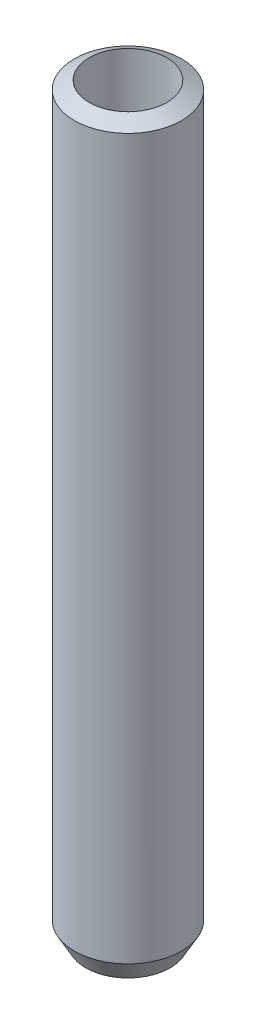
ISO-10303-21;
HEADER;
FILE_DESCRIPTION(('STEP AP214'),'2;1');
FILE_NAME('part.step','',(''),(''),'','','');
FILE_SCHEMA(('AUTOMOTIVE_DESIGN { 1 0 10303 214 1 1 1 1 }'));
ENDSEC;
DATA;
#1=APPLICATION_CONTEXT('core data for automotive mechanical design processes');
#2=APPLICATION_PROTOCOL_DEFINITION('international standard','automotive_design',2000,#1);
#3=PRODUCT_CONTEXT('',#1,'mechanical');
#4=PRODUCT('Part','Part','',(#3));
#5=PRODUCT_RELATED_PRODUCT_CATEGORY('part','',(#4));
#6=PRODUCT_DEFINITION_FORMATION('','',#4);
#7=PRODUCT_DEFINITION_CONTEXT('part definition',#1,'design');
#8=PRODUCT_DEFINITION('design','',#6,#7);
#9=PRODUCT_DEFINITION_SHAPE('','',#8);
#10=(LENGTH_UNIT() NAMED_UNIT(*) SI_UNIT(.MILLI.,.METRE.));
#11=(NAMED_UNIT(*) PLANE_ANGLE_UNIT() SI_UNIT($,.RADIAN.));
#12=(NAMED_UNIT(*) SI_UNIT($,.STERADIAN.) SOLID_ANGLE_UNIT());
#13=UNCERTAINTY_MEASURE_WITH_UNIT(LENGTH_MEASURE(1.E-05),#10,'distance_accuracy_value','');
#14=(GEOMETRIC_REPRESENTATION_CONTEXT(3) GLOBAL_UNCERTAINTY_ASSIGNED_CONTEXT((#13)) GLOBAL_UNIT_ASSIGNED_CONTEXT((#10,
#11,#12)) REPRESENTATION_CONTEXT('',''));
#15=CARTESIAN_POINT('',(0.,0.,0.));
#16=DIRECTION('',(0.,0.,1.));
#17=DIRECTION('',(1.,0.,0.));
#18=AXIS2_PLACEMENT_3D('',#15,#16,#17);
#19=CARTESIAN_POINT('',(0.,350.316945486305,0.));
#20=DIRECTION('',(0.,-1.,0.));
#21=DIRECTION('',(0.,0.,-1.));
#22=AXIS2_PLACEMENT_3D('',#19,#20,#21);
#23=CYLINDRICAL_SURFACE('',#22,25.);
#24=CARTESIAN_POINT('',(0.,345.020617295996,0.));
#25=DIRECTION('',(0.,1.,0.));
#26=DIRECTION('',(0.,0.,1.));
#27=AXIS2_PLACEMENT_3D('',#24,#25,#26);
#28=CIRCLE('',#27,25.);
#29=CARTESIAN_POINT('',(0.,345.020617295996,25.));
#30=VERTEX_POINT('',#29);
#31=EDGE_CURVE('E50',#30,#30,#28,.F.);
#32=ORIENTED_EDGE('',*,*,#31,.T.);
#33=EDGE_LOOP('',(#32));
#34=FACE_BOUND('',#33,.T.);
#35=CARTESIAN_POINT('',(0.,9.45453848438332,0.));
#36=DIRECTION('',(0.,1.,0.));
#37=DIRECTION('',(0.,0.,1.));
#38=AXIS2_PLACEMENT_3D('',#35,#36,#37);
#39=CIRCLE('',#38,25.);
#40=CARTESIAN_POINT('',(0.,9.45453848438332,25.));
#41=VERTEX_POINT('',#40);
#42=EDGE_CURVE('E51',#41,#41,#39,.T.);
#43=ORIENTED_EDGE('',*,*,#42,.T.);
#44=EDGE_LOOP('',(#43));
#45=FACE_BOUND('',#44,.T.);
#46=ADVANCED_FACE('F39',(#34,#45),#23,.T.);
#47=CARTESIAN_POINT('',(0.,0.,0.));
#48=DIRECTION('',(0.,1.,0.));
#49=DIRECTION('',(0.,0.,1.));
#50=AXIS2_PLACEMENT_3D('',#47,#48,#49);
#51=PLANE('',#50);
#52=CARTESIAN_POINT('',(0.,0.,0.));
#53=DIRECTION('',(0.,1.,0.));
#54=DIRECTION('',(0.,0.,1.));
#55=AXIS2_PLACEMENT_3D('',#52,#53,#54);
#56=CIRCLE('',#55,19.7036718096912);
#57=CARTESIAN_POINT('',(0.,0.,19.7036718096912));
#58=VERTEX_POINT('',#57);
#59=EDGE_CURVE('E10',#58,#58,#56,.F.);
#60=ORIENTED_EDGE('',*,*,#59,.T.);
#61=EDGE_LOOP('',(#60));
#62=FACE_BOUND('',#61,.T.);
#63=CARTESIAN_POINT('',(0.,0.,0.));
#64=DIRECTION('',(0.,1.,0.));
#65=DIRECTION('',(0.,0.,1.));
#66=AXIS2_PLACEMENT_3D('',#63,#64,#65);
#67=CIRCLE('',#66,18.1041214693765);
#68=CARTESIAN_POINT('',(0.,0.,18.1041214693765));
#69=VERTEX_POINT('',#68);
#70=EDGE_CURVE('E58',#69,#69,#67,.T.);
#71=ORIENTED_EDGE('',*,*,#70,.T.);
#72=EDGE_LOOP('',(#71));
#73=FACE_BOUND('',#72,.T.);
#74=ADVANCED_FACE('F62',(#62,#73),#51,.F.);
#75=CARTESIAN_POINT('',(0.,350.316945486305,0.));
#76=DIRECTION('',(0.,-1.,0.));
#77=DIRECTION('',(0.,0.,-1.));
#78=AXIS2_PLACEMENT_3D('',#75,#76,#77);
#79=CYLINDRICAL_SURFACE('',#78,18.1041214693765);
#80=CARTESIAN_POINT('',(0.,348.883612398191,0.));
#81=DIRECTION('',(0.,-1.,0.));
#82=DIRECTION('',(0.,0.,-1.));
#83=AXIS2_PLACEMENT_3D('',#80,#81,#82);
#84=CIRCLE('',#83,18.1041214693765);
#85=CARTESIAN_POINT('',(0.,348.883612398191,-18.1041214693765));
#86=VERTEX_POINT('',#85);
#87=EDGE_CURVE('E54',#86,#86,#84,.F.);
#88=ORIENTED_EDGE('',*,*,#87,.T.);
#89=EDGE_LOOP('',(#88));
#90=FACE_BOUND('',#89,.T.);
#91=ORIENTED_EDGE('',*,*,#70,.F.);
#92=EDGE_LOOP('',(#91));
#93=FACE_BOUND('',#92,.T.);
#94=ADVANCED_FACE('F68',(#90,#93),#79,.F.);
#95=CARTESIAN_POINT('',(0.,350.316945486305,0.));
#96=DIRECTION('',(0.,-1.,0.));
#97=DIRECTION('',(0.,0.,-1.));
#98=AXIS2_PLACEMENT_3D('',#95,#96,#97);
#99=CONICAL_SURFACE('',#98,15.5454615156167,1.06016415868899);
#100=ORIENTED_EDGE('',*,*,#31,.F.);
#101=EDGE_LOOP('',(#100));
#102=FACE_BOUND('',#101,.T.);
#103=ORIENTED_EDGE('',*,*,#87,.F.);
#104=EDGE_LOOP('',(#103));
#105=FACE_BOUND('',#104,.T.);
#106=ADVANCED_FACE('F66',(#102,#105),#99,.T.);
#107=CARTESIAN_POINT('',(0.,9.45453848438332,0.));
#108=DIRECTION('',(0.,1.,0.));
#109=DIRECTION('',(0.,0.,1.));
#110=AXIS2_PLACEMENT_3D('',#107,#108,#109);
#111=CONICAL_SURFACE('',#110,25.,0.510632168105908);
#112=ORIENTED_EDGE('',*,*,#59,.F.);
#113=EDGE_LOOP('',(#112));
#114=FACE_BOUND('',#113,.T.);
#115=ORIENTED_EDGE('',*,*,#42,.F.);
#116=EDGE_LOOP('',(#115));
#117=FACE_BOUND('',#116,.T.);
#118=ADVANCED_FACE('F45',(#114,#117),#111,.T.);
#119=CLOSED_SHELL('',(#46,#74,#94,#106,#118));
#120=MANIFOLD_SOLID_BREP('B2',#119);
#121=ADVANCED_BREP_SHAPE_REPRESENTATION('',(#18,#120),#14);
#122=SHAPE_DEFINITION_REPRESENTATION(#9,#121);
ENDSEC;
END-ISO-10303-21;
